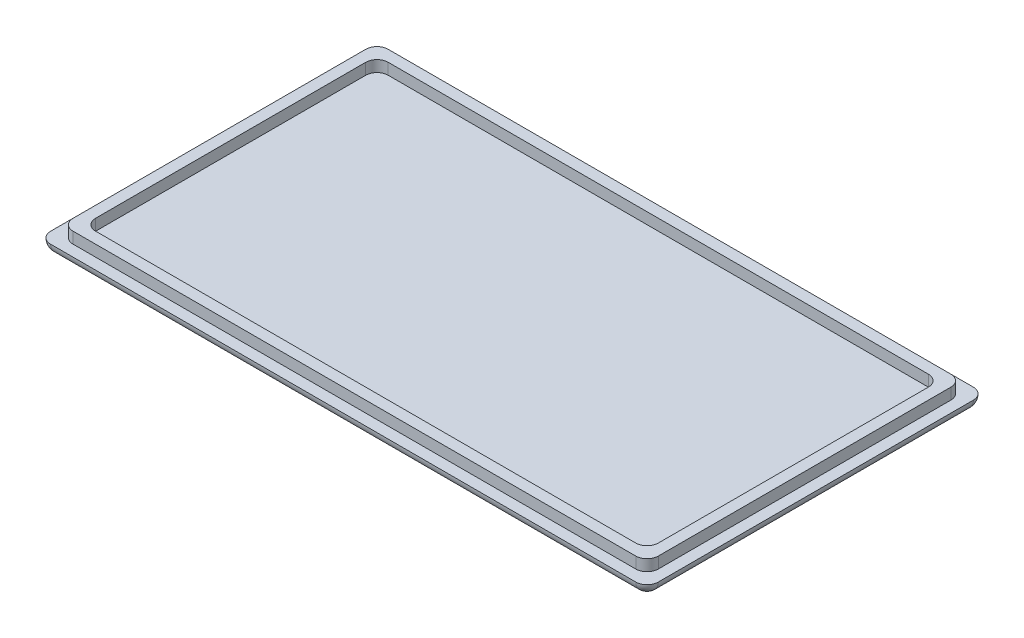
ISO-10303-21;
HEADER;
FILE_DESCRIPTION(('STEP AP214'),'2;1');
FILE_NAME('part.step','',(''),(''),'','','');
FILE_SCHEMA(('AUTOMOTIVE_DESIGN { 1 0 10303 214 1 1 1 1 }'));
ENDSEC;
DATA;
#1=APPLICATION_CONTEXT('core data for automotive mechanical design processes');
#2=APPLICATION_PROTOCOL_DEFINITION('international standard','automotive_design',2000,#1);
#3=PRODUCT_CONTEXT('',#1,'mechanical');
#4=PRODUCT('Part','Part','',(#3));
#5=PRODUCT_RELATED_PRODUCT_CATEGORY('part','',(#4));
#6=PRODUCT_DEFINITION_FORMATION('','',#4);
#7=PRODUCT_DEFINITION_CONTEXT('part definition',#1,'design');
#8=PRODUCT_DEFINITION('design','',#6,#7);
#9=PRODUCT_DEFINITION_SHAPE('','',#8);
#10=(LENGTH_UNIT() NAMED_UNIT(*) SI_UNIT(.MILLI.,.METRE.));
#11=(NAMED_UNIT(*) PLANE_ANGLE_UNIT() SI_UNIT($,.RADIAN.));
#12=(NAMED_UNIT(*) SI_UNIT($,.STERADIAN.) SOLID_ANGLE_UNIT());
#13=UNCERTAINTY_MEASURE_WITH_UNIT(LENGTH_MEASURE(1.E-05),#10,'distance_accuracy_value','');
#14=(GEOMETRIC_REPRESENTATION_CONTEXT(3) GLOBAL_UNCERTAINTY_ASSIGNED_CONTEXT((#13)) GLOBAL_UNIT_ASSIGNED_CONTEXT((#10,
#11,#12)) REPRESENTATION_CONTEXT('',''));
#15=CARTESIAN_POINT('',(0.,0.,0.));
#16=DIRECTION('',(0.,0.,1.));
#17=DIRECTION('',(1.,0.,0.));
#18=AXIS2_PLACEMENT_3D('',#15,#16,#17);
#19=CARTESIAN_POINT('',(0.,5.,0.));
#20=DIRECTION('',(0.,-1.,0.));
#21=DIRECTION('',(0.,0.,-1.));
#22=AXIS2_PLACEMENT_3D('',#19,#20,#21);
#23=PLANE('',#22);
#24=DIRECTION('',(1.,0.,0.));
#25=VECTOR('',#24,1.);
#26=CARTESIAN_POINT('',(-135.,5.,75.));
#27=LINE('',#26,#25);
#28=CARTESIAN_POINT('',(-130.,5.,75.));
#29=VERTEX_POINT('',#28);
#30=CARTESIAN_POINT('',(130.,5.,75.));
#31=VERTEX_POINT('',#30);
#32=EDGE_CURVE('E187',#29,#31,#27,.T.);
#33=ORIENTED_EDGE('',*,*,#32,.T.);
#34=CARTESIAN_POINT('',(130.,5.,70.));
#35=DIRECTION('',(0.,-1.,0.));
#36=DIRECTION('',(0.,0.,-1.));
#37=AXIS2_PLACEMENT_3D('',#34,#35,#36);
#38=CIRCLE('',#37,5.);
#39=CARTESIAN_POINT('',(135.,5.,70.));
#40=VERTEX_POINT('',#39);
#41=EDGE_CURVE('E279',#31,#40,#38,.F.);
#42=ORIENTED_EDGE('',*,*,#41,.T.);
#43=DIRECTION('',(0.,0.,-1.));
#44=VECTOR('',#43,1.);
#45=CARTESIAN_POINT('',(135.,5.,75.));
#46=LINE('',#45,#44);
#47=CARTESIAN_POINT('',(135.,5.,-70.));
#48=VERTEX_POINT('',#47);
#49=EDGE_CURVE('E345',#40,#48,#46,.T.);
#50=ORIENTED_EDGE('',*,*,#49,.T.);
#51=CARTESIAN_POINT('',(130.,5.,-70.));
#52=DIRECTION('',(0.,-1.,0.));
#53=DIRECTION('',(0.,0.,-1.));
#54=AXIS2_PLACEMENT_3D('',#51,#52,#53);
#55=CIRCLE('',#54,5.);
#56=CARTESIAN_POINT('',(130.,5.,-75.));
#57=VERTEX_POINT('',#56);
#58=EDGE_CURVE('E277',#48,#57,#55,.F.);
#59=ORIENTED_EDGE('',*,*,#58,.T.);
#60=DIRECTION('',(-1.,0.,0.));
#61=VECTOR('',#60,1.);
#62=CARTESIAN_POINT('',(-135.,5.,-75.));
#63=LINE('',#62,#61);
#64=CARTESIAN_POINT('',(-130.,5.,-75.));
#65=VERTEX_POINT('',#64);
#66=EDGE_CURVE('E212',#57,#65,#63,.T.);
#67=ORIENTED_EDGE('',*,*,#66,.T.);
#68=CARTESIAN_POINT('',(-130.,5.,-70.));
#69=DIRECTION('',(0.,-1.,0.));
#70=DIRECTION('',(0.,0.,-1.));
#71=AXIS2_PLACEMENT_3D('',#68,#69,#70);
#72=CIRCLE('',#71,5.);
#73=CARTESIAN_POINT('',(-135.,5.,-70.));
#74=VERTEX_POINT('',#73);
#75=EDGE_CURVE('E193',#65,#74,#72,.F.);
#76=ORIENTED_EDGE('',*,*,#75,.T.);
#77=DIRECTION('',(0.,0.,1.));
#78=VECTOR('',#77,1.);
#79=CARTESIAN_POINT('',(-135.,5.,75.));
#80=LINE('',#79,#78);
#81=CARTESIAN_POINT('',(-135.,5.,70.));
#82=VERTEX_POINT('',#81);
#83=EDGE_CURVE('E189',#74,#82,#80,.T.);
#84=ORIENTED_EDGE('',*,*,#83,.T.);
#85=CARTESIAN_POINT('',(-130.,5.,70.));
#86=DIRECTION('',(0.,-1.,0.));
#87=DIRECTION('',(0.,0.,-1.));
#88=AXIS2_PLACEMENT_3D('',#85,#86,#87);
#89=CIRCLE('',#88,5.);
#90=EDGE_CURVE('E184',#82,#29,#89,.F.);
#91=ORIENTED_EDGE('',*,*,#90,.T.);
#92=EDGE_LOOP('',(#33,#42,#50,#59,#67,#76,#84,#91));
#93=FACE_BOUND('',#92,.T.);
#94=DIRECTION('',(1.,0.,0.));
#95=VECTOR('',#94,1.);
#96=CARTESIAN_POINT('',(-130.,5.,70.));
#97=LINE('',#96,#95);
#98=CARTESIAN_POINT('',(-125.,5.,70.));
#99=VERTEX_POINT('',#98);
#100=CARTESIAN_POINT('',(125.,5.,70.));
#101=VERTEX_POINT('',#100);
#102=EDGE_CURVE('E346',#99,#101,#97,.T.);
#103=ORIENTED_EDGE('',*,*,#102,.F.);
#104=CARTESIAN_POINT('',(-125.,5.,65.));
#105=DIRECTION('',(0.,-1.,0.));
#106=DIRECTION('',(0.,0.,-1.));
#107=AXIS2_PLACEMENT_3D('',#104,#105,#106);
#108=CIRCLE('',#107,5.);
#109=CARTESIAN_POINT('',(-130.,5.,65.));
#110=VERTEX_POINT('',#109);
#111=EDGE_CURVE('E283',#99,#110,#108,.T.);
#112=ORIENTED_EDGE('',*,*,#111,.T.);
#113=DIRECTION('',(0.,0.,1.));
#114=VECTOR('',#113,1.);
#115=CARTESIAN_POINT('',(-130.,5.,-70.));
#116=LINE('',#115,#114);
#117=CARTESIAN_POINT('',(-130.,5.,-65.));
#118=VERTEX_POINT('',#117);
#119=EDGE_CURVE('E336',#118,#110,#116,.T.);
#120=ORIENTED_EDGE('',*,*,#119,.F.);
#121=CARTESIAN_POINT('',(-125.,5.,-65.));
#122=DIRECTION('',(0.,-1.,0.));
#123=DIRECTION('',(0.,0.,-1.));
#124=AXIS2_PLACEMENT_3D('',#121,#122,#123);
#125=CIRCLE('',#124,5.);
#126=CARTESIAN_POINT('',(-125.,5.,-70.));
#127=VERTEX_POINT('',#126);
#128=EDGE_CURVE('E11',#118,#127,#125,.T.);
#129=ORIENTED_EDGE('',*,*,#128,.T.);
#130=DIRECTION('',(-1.,0.,0.));
#131=VECTOR('',#130,1.);
#132=CARTESIAN_POINT('',(130.,5.,-70.));
#133=LINE('',#132,#131);
#134=CARTESIAN_POINT('',(125.,5.,-70.));
#135=VERTEX_POINT('',#134);
#136=EDGE_CURVE('E352',#135,#127,#133,.T.);
#137=ORIENTED_EDGE('',*,*,#136,.F.);
#138=CARTESIAN_POINT('',(125.,5.,-65.));
#139=DIRECTION('',(0.,-1.,0.));
#140=DIRECTION('',(0.,0.,-1.));
#141=AXIS2_PLACEMENT_3D('',#138,#139,#140);
#142=CIRCLE('',#141,5.);
#143=CARTESIAN_POINT('',(130.,5.,-65.));
#144=VERTEX_POINT('',#143);
#145=EDGE_CURVE('E56',#135,#144,#142,.T.);
#146=ORIENTED_EDGE('',*,*,#145,.T.);
#147=DIRECTION('',(0.,0.,-1.));
#148=VECTOR('',#147,1.);
#149=CARTESIAN_POINT('',(130.,5.,70.));
#150=LINE('',#149,#148);
#151=CARTESIAN_POINT('',(130.,5.,65.));
#152=VERTEX_POINT('',#151);
#153=EDGE_CURVE('E349',#152,#144,#150,.T.);
#154=ORIENTED_EDGE('',*,*,#153,.F.);
#155=CARTESIAN_POINT('',(125.,5.,65.));
#156=DIRECTION('',(0.,-1.,0.));
#157=DIRECTION('',(0.,0.,-1.));
#158=AXIS2_PLACEMENT_3D('',#155,#156,#157);
#159=CIRCLE('',#158,5.);
#160=EDGE_CURVE('E285',#152,#101,#159,.T.);
#161=ORIENTED_EDGE('',*,*,#160,.T.);
#162=EDGE_LOOP('',(#103,#112,#120,#129,#137,#146,#154,#161));
#163=FACE_BOUND('',#162,.T.);
#164=ADVANCED_FACE('F33',(#93,#163),#23,.F.);
#165=CARTESIAN_POINT('',(0.,0.,0.));
#166=DIRECTION('',(0.,-1.,0.));
#167=DIRECTION('',(0.,0.,-1.));
#168=AXIS2_PLACEMENT_3D('',#165,#166,#167);
#169=PLANE('',#168);
#170=DIRECTION('',(0.,0.,-1.));
#171=VECTOR('',#170,1.);
#172=CARTESIAN_POINT('',(130.,0.,75.));
#173=LINE('',#172,#171);
#174=CARTESIAN_POINT('',(130.,0.,-70.));
#175=VERTEX_POINT('',#174);
#176=CARTESIAN_POINT('',(130.,0.,70.));
#177=VERTEX_POINT('',#176);
#178=EDGE_CURVE('E217',#175,#177,#173,.F.);
#179=ORIENTED_EDGE('',*,*,#178,.T.);
#180=DIRECTION('',(1.,0.,0.));
#181=VECTOR('',#180,1.);
#182=CARTESIAN_POINT('',(-135.,0.,70.));
#183=LINE('',#182,#181);
#184=CARTESIAN_POINT('',(-130.,0.,70.));
#185=VERTEX_POINT('',#184);
#186=EDGE_CURVE('E219',#177,#185,#183,.F.);
#187=ORIENTED_EDGE('',*,*,#186,.T.);
#188=DIRECTION('',(0.,0.,1.));
#189=VECTOR('',#188,1.);
#190=CARTESIAN_POINT('',(-130.,0.,-75.));
#191=LINE('',#190,#189);
#192=CARTESIAN_POINT('',(-130.,0.,-70.));
#193=VERTEX_POINT('',#192);
#194=EDGE_CURVE('E208',#185,#193,#191,.F.);
#195=ORIENTED_EDGE('',*,*,#194,.T.);
#196=DIRECTION('',(-1.,0.,0.));
#197=VECTOR('',#196,1.);
#198=CARTESIAN_POINT('',(135.,0.,-70.));
#199=LINE('',#198,#197);
#200=EDGE_CURVE('E210',#193,#175,#199,.F.);
#201=ORIENTED_EDGE('',*,*,#200,.T.);
#202=EDGE_LOOP('',(#179,#187,#195,#201));
#203=FACE_BOUND('',#202,.T.);
#204=ADVANCED_FACE('F364',(#203),#169,.T.);
#205=CARTESIAN_POINT('',(0.,10.,0.));
#206=DIRECTION('',(0.,1.,0.));
#207=DIRECTION('',(0.,0.,1.));
#208=AXIS2_PLACEMENT_3D('',#205,#206,#207);
#209=PLANE('',#208);
#210=DIRECTION('',(0.,0.,1.));
#211=VECTOR('',#210,1.);
#212=CARTESIAN_POINT('',(-130.,10.,-70.));
#213=LINE('',#212,#211);
#214=CARTESIAN_POINT('',(-130.,10.,-65.));
#215=VERTEX_POINT('',#214);
#216=CARTESIAN_POINT('',(-130.,10.,65.));
#217=VERTEX_POINT('',#216);
#218=EDGE_CURVE('E342',#215,#217,#213,.T.);
#219=ORIENTED_EDGE('',*,*,#218,.T.);
#220=CARTESIAN_POINT('',(-125.,10.,65.));
#221=DIRECTION('',(0.,1.,0.));
#222=DIRECTION('',(0.,0.,1.));
#223=AXIS2_PLACEMENT_3D('',#220,#221,#222);
#224=CIRCLE('',#223,5.);
#225=CARTESIAN_POINT('',(-125.,10.,70.));
#226=VERTEX_POINT('',#225);
#227=EDGE_CURVE('E256',#217,#226,#224,.T.);
#228=ORIENTED_EDGE('',*,*,#227,.T.);
#229=DIRECTION('',(1.,0.,0.));
#230=VECTOR('',#229,1.);
#231=CARTESIAN_POINT('',(-130.,10.,70.));
#232=LINE('',#231,#230);
#233=CARTESIAN_POINT('',(125.,10.,70.));
#234=VERTEX_POINT('',#233);
#235=EDGE_CURVE('E332',#226,#234,#232,.T.);
#236=ORIENTED_EDGE('',*,*,#235,.T.);
#237=CARTESIAN_POINT('',(125.,10.,65.));
#238=DIRECTION('',(0.,1.,0.));
#239=DIRECTION('',(0.,0.,1.));
#240=AXIS2_PLACEMENT_3D('',#237,#238,#239);
#241=CIRCLE('',#240,5.);
#242=CARTESIAN_POINT('',(130.,10.,65.));
#243=VERTEX_POINT('',#242);
#244=EDGE_CURVE('E254',#234,#243,#241,.T.);
#245=ORIENTED_EDGE('',*,*,#244,.T.);
#246=DIRECTION('',(0.,0.,-1.));
#247=VECTOR('',#246,1.);
#248=CARTESIAN_POINT('',(130.,10.,70.));
#249=LINE('',#248,#247);
#250=CARTESIAN_POINT('',(130.,10.,-65.));
#251=VERTEX_POINT('',#250);
#252=EDGE_CURVE('E335',#243,#251,#249,.T.);
#253=ORIENTED_EDGE('',*,*,#252,.T.);
#254=CARTESIAN_POINT('',(125.,10.,-65.));
#255=DIRECTION('',(0.,1.,0.));
#256=DIRECTION('',(0.,0.,1.));
#257=AXIS2_PLACEMENT_3D('',#254,#255,#256);
#258=CIRCLE('',#257,5.);
#259=CARTESIAN_POINT('',(125.,10.,-70.));
#260=VERTEX_POINT('',#259);
#261=EDGE_CURVE('E252',#251,#260,#258,.T.);
#262=ORIENTED_EDGE('',*,*,#261,.T.);
#263=DIRECTION('',(-1.,0.,0.));
#264=VECTOR('',#263,1.);
#265=CARTESIAN_POINT('',(130.,10.,-70.));
#266=LINE('',#265,#264);
#267=CARTESIAN_POINT('',(-125.,10.,-70.));
#268=VERTEX_POINT('',#267);
#269=EDGE_CURVE('E339',#260,#268,#266,.T.);
#270=ORIENTED_EDGE('',*,*,#269,.T.);
#271=CARTESIAN_POINT('',(-125.,10.,-65.));
#272=DIRECTION('',(0.,1.,0.));
#273=DIRECTION('',(0.,0.,1.));
#274=AXIS2_PLACEMENT_3D('',#271,#272,#273);
#275=CIRCLE('',#274,5.);
#276=EDGE_CURVE('E250',#268,#215,#275,.T.);
#277=ORIENTED_EDGE('',*,*,#276,.T.);
#278=EDGE_LOOP('',(#219,#228,#236,#245,#253,#262,#270,#277));
#279=FACE_BOUND('',#278,.T.);
#280=DIRECTION('',(0.,0.,1.));
#281=VECTOR('',#280,1.);
#282=CARTESIAN_POINT('',(-125.,10.,-65.));
#283=LINE('',#282,#281);
#284=CARTESIAN_POINT('',(-125.,10.,-60.));
#285=VERTEX_POINT('',#284);
#286=CARTESIAN_POINT('',(-125.,10.,60.));
#287=VERTEX_POINT('',#286);
#288=EDGE_CURVE('E416',#285,#287,#283,.T.);
#289=ORIENTED_EDGE('',*,*,#288,.F.);
#290=CARTESIAN_POINT('',(-120.,10.,-60.));
#291=DIRECTION('',(0.,1.,0.));
#292=DIRECTION('',(0.,0.,1.));
#293=AXIS2_PLACEMENT_3D('',#290,#291,#292);
#294=CIRCLE('',#293,5.);
#295=CARTESIAN_POINT('',(-120.,10.,-65.));
#296=VERTEX_POINT('',#295);
#297=EDGE_CURVE('E42',#285,#296,#294,.F.);
#298=ORIENTED_EDGE('',*,*,#297,.T.);
#299=DIRECTION('',(-1.,0.,0.));
#300=VECTOR('',#299,1.);
#301=CARTESIAN_POINT('',(125.,10.,-65.));
#302=LINE('',#301,#300);
#303=CARTESIAN_POINT('',(120.,10.,-65.));
#304=VERTEX_POINT('',#303);
#305=EDGE_CURVE('E331',#304,#296,#302,.T.);
#306=ORIENTED_EDGE('',*,*,#305,.F.);
#307=CARTESIAN_POINT('',(120.,10.,-60.));
#308=DIRECTION('',(0.,1.,0.));
#309=DIRECTION('',(0.,0.,1.));
#310=AXIS2_PLACEMENT_3D('',#307,#308,#309);
#311=CIRCLE('',#310,5.);
#312=CARTESIAN_POINT('',(125.,10.,-60.));
#313=VERTEX_POINT('',#312);
#314=EDGE_CURVE('E290',#304,#313,#311,.F.);
#315=ORIENTED_EDGE('',*,*,#314,.T.);
#316=DIRECTION('',(0.,0.,-1.));
#317=VECTOR('',#316,1.);
#318=CARTESIAN_POINT('',(125.,10.,65.));
#319=LINE('',#318,#317);
#320=CARTESIAN_POINT('',(125.,10.,60.));
#321=VERTEX_POINT('',#320);
#322=EDGE_CURVE('E323',#321,#313,#319,.T.);
#323=ORIENTED_EDGE('',*,*,#322,.F.);
#324=CARTESIAN_POINT('',(120.,10.,60.));
#325=DIRECTION('',(0.,1.,0.));
#326=DIRECTION('',(0.,0.,1.));
#327=AXIS2_PLACEMENT_3D('',#324,#325,#326);
#328=CIRCLE('',#327,5.);
#329=CARTESIAN_POINT('',(120.,10.,65.));
#330=VERTEX_POINT('',#329);
#331=EDGE_CURVE('E287',#321,#330,#328,.F.);
#332=ORIENTED_EDGE('',*,*,#331,.T.);
#333=DIRECTION('',(1.,0.,0.));
#334=VECTOR('',#333,1.);
#335=CARTESIAN_POINT('',(-125.,10.,65.));
#336=LINE('',#335,#334);
#337=CARTESIAN_POINT('',(-120.,10.,65.));
#338=VERTEX_POINT('',#337);
#339=EDGE_CURVE('E421',#338,#330,#336,.T.);
#340=ORIENTED_EDGE('',*,*,#339,.F.);
#341=CARTESIAN_POINT('',(-120.,10.,60.));
#342=DIRECTION('',(0.,1.,0.));
#343=DIRECTION('',(0.,0.,1.));
#344=AXIS2_PLACEMENT_3D('',#341,#342,#343);
#345=CIRCLE('',#344,5.);
#346=EDGE_CURVE('E281',#338,#287,#345,.F.);
#347=ORIENTED_EDGE('',*,*,#346,.T.);
#348=EDGE_LOOP('',(#289,#298,#306,#315,#323,#332,#340,#347));
#349=FACE_BOUND('',#348,.T.);
#350=ADVANCED_FACE('F387',(#279,#349),#209,.T.);
#351=CARTESIAN_POINT('',(-130.,10.,70.));
#352=DIRECTION('',(0.,0.,-1.));
#353=DIRECTION('',(-1.,0.,0.));
#354=AXIS2_PLACEMENT_3D('',#351,#352,#353);
#355=PLANE('',#354);
#356=ORIENTED_EDGE('',*,*,#235,.F.);
#357=DIRECTION('',(0.,-1.,0.));
#358=VECTOR('',#357,1.);
#359=CARTESIAN_POINT('',(-125.,10.,70.));
#360=LINE('',#359,#358);
#361=EDGE_CURVE('E242',#226,#99,#360,.T.);
#362=ORIENTED_EDGE('',*,*,#361,.T.);
#363=ORIENTED_EDGE('',*,*,#102,.T.);
#364=DIRECTION('',(0.,-1.,0.));
#365=VECTOR('',#364,1.);
#366=CARTESIAN_POINT('',(125.,10.,70.));
#367=LINE('',#366,#365);
#368=EDGE_CURVE('E240',#101,#234,#367,.F.);
#369=ORIENTED_EDGE('',*,*,#368,.T.);
#370=EDGE_LOOP('',(#356,#362,#363,#369));
#371=FACE_BOUND('',#370,.T.);
#372=ADVANCED_FACE('F453',(#371),#355,.F.);
#373=CARTESIAN_POINT('',(130.,10.,70.));
#374=DIRECTION('',(-1.,0.,0.));
#375=DIRECTION('',(0.,0.,1.));
#376=AXIS2_PLACEMENT_3D('',#373,#374,#375);
#377=PLANE('',#376);
#378=ORIENTED_EDGE('',*,*,#252,.F.);
#379=DIRECTION('',(0.,-1.,0.));
#380=VECTOR('',#379,1.);
#381=CARTESIAN_POINT('',(130.,10.,65.));
#382=LINE('',#381,#380);
#383=EDGE_CURVE('E260',#243,#152,#382,.T.);
#384=ORIENTED_EDGE('',*,*,#383,.T.);
#385=ORIENTED_EDGE('',*,*,#153,.T.);
#386=DIRECTION('',(0.,-1.,0.));
#387=VECTOR('',#386,1.);
#388=CARTESIAN_POINT('',(130.,10.,-65.));
#389=LINE('',#388,#387);
#390=EDGE_CURVE('E258',#144,#251,#389,.F.);
#391=ORIENTED_EDGE('',*,*,#390,.T.);
#392=EDGE_LOOP('',(#378,#384,#385,#391));
#393=FACE_BOUND('',#392,.T.);
#394=ADVANCED_FACE('F461',(#393),#377,.F.);
#395=CARTESIAN_POINT('',(130.,10.,-70.));
#396=DIRECTION('',(0.,0.,1.));
#397=DIRECTION('',(1.,0.,0.));
#398=AXIS2_PLACEMENT_3D('',#395,#396,#397);
#399=PLANE('',#398);
#400=ORIENTED_EDGE('',*,*,#269,.F.);
#401=DIRECTION('',(0.,-1.,0.));
#402=VECTOR('',#401,1.);
#403=CARTESIAN_POINT('',(125.,10.,-70.));
#404=LINE('',#403,#402);
#405=EDGE_CURVE('E270',#260,#135,#404,.T.);
#406=ORIENTED_EDGE('',*,*,#405,.T.);
#407=ORIENTED_EDGE('',*,*,#136,.T.);
#408=DIRECTION('',(0.,-1.,0.));
#409=VECTOR('',#408,1.);
#410=CARTESIAN_POINT('',(-125.,10.,-70.));
#411=LINE('',#410,#409);
#412=EDGE_CURVE('E268',#127,#268,#411,.F.);
#413=ORIENTED_EDGE('',*,*,#412,.T.);
#414=EDGE_LOOP('',(#400,#406,#407,#413));
#415=FACE_BOUND('',#414,.T.);
#416=ADVANCED_FACE('F457',(#415),#399,.F.);
#417=CARTESIAN_POINT('',(-130.,10.,-70.));
#418=DIRECTION('',(1.,0.,0.));
#419=DIRECTION('',(0.,0.,-1.));
#420=AXIS2_PLACEMENT_3D('',#417,#418,#419);
#421=PLANE('',#420);
#422=ORIENTED_EDGE('',*,*,#119,.T.);
#423=DIRECTION('',(0.,-1.,0.));
#424=VECTOR('',#423,1.);
#425=CARTESIAN_POINT('',(-130.,10.,65.));
#426=LINE('',#425,#424);
#427=EDGE_CURVE('E248',#110,#217,#426,.F.);
#428=ORIENTED_EDGE('',*,*,#427,.T.);
#429=ORIENTED_EDGE('',*,*,#218,.F.);
#430=DIRECTION('',(0.,-1.,0.));
#431=VECTOR('',#430,1.);
#432=CARTESIAN_POINT('',(-130.,10.,-65.));
#433=LINE('',#432,#431);
#434=EDGE_CURVE('E245',#215,#118,#433,.T.);
#435=ORIENTED_EDGE('',*,*,#434,.T.);
#436=EDGE_LOOP('',(#422,#428,#429,#435));
#437=FACE_BOUND('',#436,.T.);
#438=ADVANCED_FACE('F450',(#437),#421,.F.);
#439=CARTESIAN_POINT('',(125.,10.,-65.));
#440=DIRECTION('',(0.,0.,1.));
#441=DIRECTION('',(1.,0.,0.));
#442=AXIS2_PLACEMENT_3D('',#439,#440,#441);
#443=PLANE('',#442);
#444=DIRECTION('',(-1.,0.,0.));
#445=VECTOR('',#444,1.);
#446=CARTESIAN_POINT('',(125.,5.,-65.));
#447=LINE('',#446,#445);
#448=CARTESIAN_POINT('',(120.,5.,-65.));
#449=VERTEX_POINT('',#448);
#450=CARTESIAN_POINT('',(-120.,5.,-65.));
#451=VERTEX_POINT('',#450);
#452=EDGE_CURVE('E309',#449,#451,#447,.T.);
#453=ORIENTED_EDGE('',*,*,#452,.F.);
#454=DIRECTION('',(0.,-1.,0.));
#455=VECTOR('',#454,1.);
#456=CARTESIAN_POINT('',(120.,10.,-65.));
#457=LINE('',#456,#455);
#458=EDGE_CURVE('E194',#449,#304,#457,.F.);
#459=ORIENTED_EDGE('',*,*,#458,.T.);
#460=ORIENTED_EDGE('',*,*,#305,.T.);
#461=DIRECTION('',(0.,-1.,0.));
#462=VECTOR('',#461,1.);
#463=CARTESIAN_POINT('',(-120.,5.,-65.));
#464=LINE('',#463,#462);
#465=EDGE_CURVE('E272',#296,#451,#464,.T.);
#466=ORIENTED_EDGE('',*,*,#465,.T.);
#467=EDGE_LOOP('',(#453,#459,#460,#466));
#468=FACE_BOUND('',#467,.T.);
#469=ADVANCED_FACE('F418',(#468),#443,.T.);
#470=CARTESIAN_POINT('',(-125.,10.,-65.));
#471=DIRECTION('',(1.,0.,0.));
#472=DIRECTION('',(0.,0.,-1.));
#473=AXIS2_PLACEMENT_3D('',#470,#471,#472);
#474=PLANE('',#473);
#475=ORIENTED_EDGE('',*,*,#288,.T.);
#476=DIRECTION('',(0.,-1.,0.));
#477=VECTOR('',#476,1.);
#478=CARTESIAN_POINT('',(-125.,5.,60.));
#479=LINE('',#478,#477);
#480=CARTESIAN_POINT('',(-125.,5.,60.));
#481=VERTEX_POINT('',#480);
#482=EDGE_CURVE('E224',#287,#481,#479,.T.);
#483=ORIENTED_EDGE('',*,*,#482,.T.);
#484=DIRECTION('',(0.,0.,1.));
#485=VECTOR('',#484,1.);
#486=CARTESIAN_POINT('',(-125.,5.,-65.));
#487=LINE('',#486,#485);
#488=CARTESIAN_POINT('',(-125.,5.,-60.));
#489=VERTEX_POINT('',#488);
#490=EDGE_CURVE('E315',#489,#481,#487,.T.);
#491=ORIENTED_EDGE('',*,*,#490,.F.);
#492=DIRECTION('',(0.,-1.,0.));
#493=VECTOR('',#492,1.);
#494=CARTESIAN_POINT('',(-125.,10.,-60.));
#495=LINE('',#494,#493);
#496=EDGE_CURVE('E222',#489,#285,#495,.F.);
#497=ORIENTED_EDGE('',*,*,#496,.T.);
#498=EDGE_LOOP('',(#475,#483,#491,#497));
#499=FACE_BOUND('',#498,.T.);
#500=ADVANCED_FACE('F405',(#499),#474,.T.);
#501=CARTESIAN_POINT('',(-125.,10.,65.));
#502=DIRECTION('',(0.,0.,-1.));
#503=DIRECTION('',(-1.,0.,0.));
#504=AXIS2_PLACEMENT_3D('',#501,#502,#503);
#505=PLANE('',#504);
#506=DIRECTION('',(1.,0.,0.));
#507=VECTOR('',#506,1.);
#508=CARTESIAN_POINT('',(-125.,5.,65.));
#509=LINE('',#508,#507);
#510=CARTESIAN_POINT('',(-120.,5.,65.));
#511=VERTEX_POINT('',#510);
#512=CARTESIAN_POINT('',(120.,5.,65.));
#513=VERTEX_POINT('',#512);
#514=EDGE_CURVE('E320',#511,#513,#509,.T.);
#515=ORIENTED_EDGE('',*,*,#514,.F.);
#516=DIRECTION('',(0.,-1.,0.));
#517=VECTOR('',#516,1.);
#518=CARTESIAN_POINT('',(-120.,10.,65.));
#519=LINE('',#518,#517);
#520=EDGE_CURVE('E238',#511,#338,#519,.F.);
#521=ORIENTED_EDGE('',*,*,#520,.T.);
#522=ORIENTED_EDGE('',*,*,#339,.T.);
#523=DIRECTION('',(0.,-1.,0.));
#524=VECTOR('',#523,1.);
#525=CARTESIAN_POINT('',(120.,5.,65.));
#526=LINE('',#525,#524);
#527=EDGE_CURVE('E235',#330,#513,#526,.T.);
#528=ORIENTED_EDGE('',*,*,#527,.T.);
#529=EDGE_LOOP('',(#515,#521,#522,#528));
#530=FACE_BOUND('',#529,.T.);
#531=ADVANCED_FACE('F397',(#530),#505,.T.);
#532=CARTESIAN_POINT('',(125.,10.,65.));
#533=DIRECTION('',(-1.,0.,0.));
#534=DIRECTION('',(0.,0.,1.));
#535=AXIS2_PLACEMENT_3D('',#532,#533,#534);
#536=PLANE('',#535);
#537=DIRECTION('',(0.,0.,-1.));
#538=VECTOR('',#537,1.);
#539=CARTESIAN_POINT('',(125.,5.,65.));
#540=LINE('',#539,#538);
#541=CARTESIAN_POINT('',(125.,5.,60.));
#542=VERTEX_POINT('',#541);
#543=CARTESIAN_POINT('',(125.,5.,-60.));
#544=VERTEX_POINT('',#543);
#545=EDGE_CURVE('E328',#542,#544,#540,.T.);
#546=ORIENTED_EDGE('',*,*,#545,.F.);
#547=DIRECTION('',(0.,-1.,0.));
#548=VECTOR('',#547,1.);
#549=CARTESIAN_POINT('',(125.,10.,60.));
#550=LINE('',#549,#548);
#551=EDGE_CURVE('E266',#542,#321,#550,.F.);
#552=ORIENTED_EDGE('',*,*,#551,.T.);
#553=ORIENTED_EDGE('',*,*,#322,.T.);
#554=DIRECTION('',(0.,-1.,0.));
#555=VECTOR('',#554,1.);
#556=CARTESIAN_POINT('',(125.,5.,-60.));
#557=LINE('',#556,#555);
#558=EDGE_CURVE('E263',#313,#544,#557,.T.);
#559=ORIENTED_EDGE('',*,*,#558,.T.);
#560=EDGE_LOOP('',(#546,#552,#553,#559));
#561=FACE_BOUND('',#560,.T.);
#562=ADVANCED_FACE('F391',(#561),#536,.T.);
#563=ORIENTED_EDGE('',*,*,#490,.T.);
#564=CARTESIAN_POINT('',(-120.,5.,60.));
#565=DIRECTION('',(0.,-1.,0.));
#566=DIRECTION('',(0.,0.,-1.));
#567=AXIS2_PLACEMENT_3D('',#564,#565,#566);
#568=CIRCLE('',#567,5.);
#569=EDGE_CURVE('E233',#481,#511,#568,.F.);
#570=ORIENTED_EDGE('',*,*,#569,.T.);
#571=ORIENTED_EDGE('',*,*,#514,.T.);
#572=CARTESIAN_POINT('',(120.,5.,60.));
#573=DIRECTION('',(0.,-1.,0.));
#574=DIRECTION('',(0.,0.,-1.));
#575=AXIS2_PLACEMENT_3D('',#572,#573,#574);
#576=CIRCLE('',#575,5.);
#577=EDGE_CURVE('E231',#513,#542,#576,.F.);
#578=ORIENTED_EDGE('',*,*,#577,.T.);
#579=ORIENTED_EDGE('',*,*,#545,.T.);
#580=CARTESIAN_POINT('',(120.,5.,-60.));
#581=DIRECTION('',(0.,-1.,0.));
#582=DIRECTION('',(0.,0.,-1.));
#583=AXIS2_PLACEMENT_3D('',#580,#581,#582);
#584=CIRCLE('',#583,5.);
#585=EDGE_CURVE('E229',#544,#449,#584,.F.);
#586=ORIENTED_EDGE('',*,*,#585,.T.);
#587=ORIENTED_EDGE('',*,*,#452,.T.);
#588=CARTESIAN_POINT('',(-120.,5.,-60.));
#589=DIRECTION('',(0.,-1.,0.));
#590=DIRECTION('',(0.,0.,-1.));
#591=AXIS2_PLACEMENT_3D('',#588,#589,#590);
#592=CIRCLE('',#591,5.);
#593=EDGE_CURVE('E227',#451,#489,#592,.F.);
#594=ORIENTED_EDGE('',*,*,#593,.T.);
#595=EDGE_LOOP('',(#563,#570,#571,#578,#579,#586,#587,#594));
#596=FACE_BOUND('',#595,.T.);
#597=ADVANCED_FACE('F383',(#596),#23,.F.);
#598=CARTESIAN_POINT('',(-135.,5.,-70.));
#599=DIRECTION('',(1.,0.,0.));
#600=DIRECTION('',(0.,0.,-1.));
#601=AXIS2_PLACEMENT_3D('',#598,#599,#600);
#602=CYLINDRICAL_SURFACE('',#601,5.);
#603=CARTESIAN_POINT('',(-130.,5.,-70.));
#604=DIRECTION('',(-1.,0.,0.));
#605=DIRECTION('',(0.,0.,1.));
#606=AXIS2_PLACEMENT_3D('',#603,#604,#605);
#607=CIRCLE('',#606,5.);
#608=EDGE_CURVE('E37',#65,#193,#607,.T.);
#609=ORIENTED_EDGE('',*,*,#608,.F.);
#610=ORIENTED_EDGE('',*,*,#66,.F.);
#611=CARTESIAN_POINT('',(130.,5.,-70.));
#612=DIRECTION('',(1.,0.,0.));
#613=DIRECTION('',(0.,0.,-1.));
#614=AXIS2_PLACEMENT_3D('',#611,#612,#613);
#615=CIRCLE('',#614,5.);
#616=EDGE_CURVE('E302',#175,#57,#615,.T.);
#617=ORIENTED_EDGE('',*,*,#616,.F.);
#618=ORIENTED_EDGE('',*,*,#200,.F.);
#619=EDGE_LOOP('',(#609,#610,#617,#618));
#620=FACE_BOUND('',#619,.T.);
#621=ADVANCED_FACE('F359',(#620),#602,.T.);
#622=CARTESIAN_POINT('',(-130.,5.,-70.));
#623=DIRECTION('',(0.,0.,1.));
#624=DIRECTION('',(1.,0.,0.));
#625=AXIS2_PLACEMENT_3D('',#622,#623,#624);
#626=SPHERICAL_SURFACE('',#625,5.);
#627=ORIENTED_EDGE('',*,*,#75,.F.);
#628=ORIENTED_EDGE('',*,*,#608,.T.);
#629=CARTESIAN_POINT('',(-130.,5.,-70.));
#630=DIRECTION('',(0.,0.,-1.));
#631=DIRECTION('',(-1.,0.,0.));
#632=AXIS2_PLACEMENT_3D('',#629,#630,#631);
#633=CIRCLE('',#632,5.);
#634=EDGE_CURVE('E300',#74,#193,#633,.F.);
#635=ORIENTED_EDGE('',*,*,#634,.F.);
#636=EDGE_LOOP('',(#627,#628,#635));
#637=FACE_BOUND('',#636,.T.);
#638=ADVANCED_FACE('F360',(#637),#626,.T.);
#639=CARTESIAN_POINT('',(130.,5.,-70.));
#640=DIRECTION('',(0.,0.,1.));
#641=DIRECTION('',(1.,0.,0.));
#642=AXIS2_PLACEMENT_3D('',#639,#640,#641);
#643=SPHERICAL_SURFACE('',#642,5.);
#644=ORIENTED_EDGE('',*,*,#616,.T.);
#645=ORIENTED_EDGE('',*,*,#58,.F.);
#646=CARTESIAN_POINT('',(130.,5.,-70.));
#647=DIRECTION('',(0.,0.,-1.));
#648=DIRECTION('',(-1.,0.,0.));
#649=AXIS2_PLACEMENT_3D('',#646,#647,#648);
#650=CIRCLE('',#649,5.);
#651=EDGE_CURVE('E297',#175,#48,#650,.F.);
#652=ORIENTED_EDGE('',*,*,#651,.F.);
#653=EDGE_LOOP('',(#644,#645,#652));
#654=FACE_BOUND('',#653,.T.);
#655=ADVANCED_FACE('F372',(#654),#643,.T.);
#656=CARTESIAN_POINT('',(-130.,5.,75.));
#657=DIRECTION('',(0.,0.,-1.));
#658=DIRECTION('',(-1.,0.,0.));
#659=AXIS2_PLACEMENT_3D('',#656,#657,#658);
#660=CYLINDRICAL_SURFACE('',#659,5.);
#661=ORIENTED_EDGE('',*,*,#634,.T.);
#662=ORIENTED_EDGE('',*,*,#194,.F.);
#663=CARTESIAN_POINT('',(-130.,5.,70.));
#664=DIRECTION('',(0.,0.,1.));
#665=DIRECTION('',(1.,0.,0.));
#666=AXIS2_PLACEMENT_3D('',#663,#664,#665);
#667=CIRCLE('',#666,5.);
#668=EDGE_CURVE('E198',#82,#185,#667,.T.);
#669=ORIENTED_EDGE('',*,*,#668,.F.);
#670=ORIENTED_EDGE('',*,*,#83,.F.);
#671=EDGE_LOOP('',(#661,#662,#669,#670));
#672=FACE_BOUND('',#671,.T.);
#673=ADVANCED_FACE('F362',(#672),#660,.T.);
#674=CARTESIAN_POINT('',(130.,5.,75.));
#675=DIRECTION('',(0.,0.,1.));
#676=DIRECTION('',(1.,0.,0.));
#677=AXIS2_PLACEMENT_3D('',#674,#675,#676);
#678=CYLINDRICAL_SURFACE('',#677,5.);
#679=ORIENTED_EDGE('',*,*,#651,.T.);
#680=ORIENTED_EDGE('',*,*,#49,.F.);
#681=CARTESIAN_POINT('',(130.,5.,70.));
#682=DIRECTION('',(0.,0.,1.));
#683=DIRECTION('',(1.,0.,0.));
#684=AXIS2_PLACEMENT_3D('',#681,#682,#683);
#685=CIRCLE('',#684,5.);
#686=EDGE_CURVE('E202',#177,#40,#685,.T.);
#687=ORIENTED_EDGE('',*,*,#686,.F.);
#688=ORIENTED_EDGE('',*,*,#178,.F.);
#689=EDGE_LOOP('',(#679,#680,#687,#688));
#690=FACE_BOUND('',#689,.T.);
#691=ADVANCED_FACE('F371',(#690),#678,.T.);
#692=CARTESIAN_POINT('',(-130.,5.,70.));
#693=DIRECTION('',(0.,0.,1.));
#694=DIRECTION('',(1.,0.,0.));
#695=AXIS2_PLACEMENT_3D('',#692,#693,#694);
#696=SPHERICAL_SURFACE('',#695,5.);
#697=ORIENTED_EDGE('',*,*,#90,.F.);
#698=ORIENTED_EDGE('',*,*,#668,.T.);
#699=CARTESIAN_POINT('',(-130.,5.,70.));
#700=DIRECTION('',(-1.,0.,0.));
#701=DIRECTION('',(0.,0.,1.));
#702=AXIS2_PLACEMENT_3D('',#699,#700,#701);
#703=CIRCLE('',#702,5.);
#704=EDGE_CURVE('E196',#29,#185,#703,.F.);
#705=ORIENTED_EDGE('',*,*,#704,.F.);
#706=EDGE_LOOP('',(#697,#698,#705));
#707=FACE_BOUND('',#706,.T.);
#708=ADVANCED_FACE('F197',(#707),#696,.T.);
#709=CARTESIAN_POINT('',(130.,5.,70.));
#710=DIRECTION('',(0.,0.,1.));
#711=DIRECTION('',(1.,0.,0.));
#712=AXIS2_PLACEMENT_3D('',#709,#710,#711);
#713=SPHERICAL_SURFACE('',#712,5.);
#714=ORIENTED_EDGE('',*,*,#686,.T.);
#715=ORIENTED_EDGE('',*,*,#41,.F.);
#716=CARTESIAN_POINT('',(130.,5.,70.));
#717=DIRECTION('',(1.,0.,0.));
#718=DIRECTION('',(0.,0.,-1.));
#719=AXIS2_PLACEMENT_3D('',#716,#717,#718);
#720=CIRCLE('',#719,5.);
#721=EDGE_CURVE('E203',#177,#31,#720,.F.);
#722=ORIENTED_EDGE('',*,*,#721,.F.);
#723=EDGE_LOOP('',(#714,#715,#722));
#724=FACE_BOUND('',#723,.T.);
#725=ADVANCED_FACE('F368',(#724),#713,.T.);
#726=CARTESIAN_POINT('',(-135.,5.,70.));
#727=DIRECTION('',(-1.,0.,0.));
#728=DIRECTION('',(0.,0.,1.));
#729=AXIS2_PLACEMENT_3D('',#726,#727,#728);
#730=CYLINDRICAL_SURFACE('',#729,5.);
#731=ORIENTED_EDGE('',*,*,#704,.T.);
#732=ORIENTED_EDGE('',*,*,#186,.F.);
#733=ORIENTED_EDGE('',*,*,#721,.T.);
#734=ORIENTED_EDGE('',*,*,#32,.F.);
#735=EDGE_LOOP('',(#731,#732,#733,#734));
#736=FACE_BOUND('',#735,.T.);
#737=ADVANCED_FACE('F205',(#736),#730,.T.);
#738=CARTESIAN_POINT('',(-120.,10.,60.));
#739=DIRECTION('',(0.,1.,0.));
#740=DIRECTION('',(0.,0.,1.));
#741=AXIS2_PLACEMENT_3D('',#738,#739,#740);
#742=CYLINDRICAL_SURFACE('',#741,5.);
#743=ORIENTED_EDGE('',*,*,#346,.F.);
#744=ORIENTED_EDGE('',*,*,#520,.F.);
#745=ORIENTED_EDGE('',*,*,#569,.F.);
#746=ORIENTED_EDGE('',*,*,#482,.F.);
#747=EDGE_LOOP('',(#743,#744,#745,#746));
#748=FACE_BOUND('',#747,.T.);
#749=ADVANCED_FACE('F440',(#748),#742,.F.);
#750=CARTESIAN_POINT('',(-125.,10.,65.));
#751=DIRECTION('',(0.,-1.,0.));
#752=DIRECTION('',(0.,0.,-1.));
#753=AXIS2_PLACEMENT_3D('',#750,#751,#752);
#754=CYLINDRICAL_SURFACE('',#753,5.);
#755=ORIENTED_EDGE('',*,*,#227,.F.);
#756=ORIENTED_EDGE('',*,*,#427,.F.);
#757=ORIENTED_EDGE('',*,*,#111,.F.);
#758=ORIENTED_EDGE('',*,*,#361,.F.);
#759=EDGE_LOOP('',(#755,#756,#757,#758));
#760=FACE_BOUND('',#759,.T.);
#761=ADVANCED_FACE('F476',(#760),#754,.T.);
#762=CARTESIAN_POINT('',(125.,10.,65.));
#763=DIRECTION('',(0.,-1.,0.));
#764=DIRECTION('',(0.,0.,-1.));
#765=AXIS2_PLACEMENT_3D('',#762,#763,#764);
#766=CYLINDRICAL_SURFACE('',#765,5.);
#767=ORIENTED_EDGE('',*,*,#244,.F.);
#768=ORIENTED_EDGE('',*,*,#368,.F.);
#769=ORIENTED_EDGE('',*,*,#160,.F.);
#770=ORIENTED_EDGE('',*,*,#383,.F.);
#771=EDGE_LOOP('',(#767,#768,#769,#770));
#772=FACE_BOUND('',#771,.T.);
#773=ADVANCED_FACE('F490',(#772),#766,.T.);
#774=CARTESIAN_POINT('',(120.,10.,60.));
#775=DIRECTION('',(0.,1.,0.));
#776=DIRECTION('',(0.,0.,1.));
#777=AXIS2_PLACEMENT_3D('',#774,#775,#776);
#778=CYLINDRICAL_SURFACE('',#777,5.);
#779=ORIENTED_EDGE('',*,*,#331,.F.);
#780=ORIENTED_EDGE('',*,*,#551,.F.);
#781=ORIENTED_EDGE('',*,*,#577,.F.);
#782=ORIENTED_EDGE('',*,*,#527,.F.);
#783=EDGE_LOOP('',(#779,#780,#781,#782));
#784=FACE_BOUND('',#783,.T.);
#785=ADVANCED_FACE('F436',(#784),#778,.F.);
#786=CARTESIAN_POINT('',(125.,10.,-65.));
#787=DIRECTION('',(0.,-1.,0.));
#788=DIRECTION('',(0.,0.,-1.));
#789=AXIS2_PLACEMENT_3D('',#786,#787,#788);
#790=CYLINDRICAL_SURFACE('',#789,5.);
#791=ORIENTED_EDGE('',*,*,#261,.F.);
#792=ORIENTED_EDGE('',*,*,#390,.F.);
#793=ORIENTED_EDGE('',*,*,#145,.F.);
#794=ORIENTED_EDGE('',*,*,#405,.F.);
#795=EDGE_LOOP('',(#791,#792,#793,#794));
#796=FACE_BOUND('',#795,.T.);
#797=ADVANCED_FACE('F486',(#796),#790,.T.);
#798=CARTESIAN_POINT('',(120.,10.,-60.));
#799=DIRECTION('',(0.,1.,0.));
#800=DIRECTION('',(0.,0.,1.));
#801=AXIS2_PLACEMENT_3D('',#798,#799,#800);
#802=CYLINDRICAL_SURFACE('',#801,5.);
#803=ORIENTED_EDGE('',*,*,#314,.F.);
#804=ORIENTED_EDGE('',*,*,#458,.F.);
#805=ORIENTED_EDGE('',*,*,#585,.F.);
#806=ORIENTED_EDGE('',*,*,#558,.F.);
#807=EDGE_LOOP('',(#803,#804,#805,#806));
#808=FACE_BOUND('',#807,.T.);
#809=ADVANCED_FACE('F434',(#808),#802,.F.);
#810=CARTESIAN_POINT('',(-120.,10.,-60.));
#811=DIRECTION('',(0.,1.,0.));
#812=DIRECTION('',(0.,0.,1.));
#813=AXIS2_PLACEMENT_3D('',#810,#811,#812);
#814=CYLINDRICAL_SURFACE('',#813,5.);
#815=ORIENTED_EDGE('',*,*,#297,.F.);
#816=ORIENTED_EDGE('',*,*,#496,.F.);
#817=ORIENTED_EDGE('',*,*,#593,.F.);
#818=ORIENTED_EDGE('',*,*,#465,.F.);
#819=EDGE_LOOP('',(#815,#816,#817,#818));
#820=FACE_BOUND('',#819,.T.);
#821=ADVANCED_FACE('F410',(#820),#814,.F.);
#822=CARTESIAN_POINT('',(-125.,10.,-65.));
#823=DIRECTION('',(0.,-1.,0.));
#824=DIRECTION('',(0.,0.,-1.));
#825=AXIS2_PLACEMENT_3D('',#822,#823,#824);
#826=CYLINDRICAL_SURFACE('',#825,5.);
#827=ORIENTED_EDGE('',*,*,#276,.F.);
#828=ORIENTED_EDGE('',*,*,#412,.F.);
#829=ORIENTED_EDGE('',*,*,#128,.F.);
#830=ORIENTED_EDGE('',*,*,#434,.F.);
#831=EDGE_LOOP('',(#827,#828,#829,#830));
#832=FACE_BOUND('',#831,.T.);
#833=ADVANCED_FACE('F35',(#832),#826,.T.);
#834=CLOSED_SHELL('',(#164,#204,#350,#372,#394,#416,#438,#469,#500,#531,#562,#597,#621,#638,
#655,#673,#691,#708,#725,#737,#749,#761,#773,#785,#797,#809,#821,#833));
#835=MANIFOLD_SOLID_BREP('B2',#834);
#836=ADVANCED_BREP_SHAPE_REPRESENTATION('',(#18,#835),#14);
#837=SHAPE_DEFINITION_REPRESENTATION(#9,#836);
ENDSEC;
END-ISO-10303-21;
